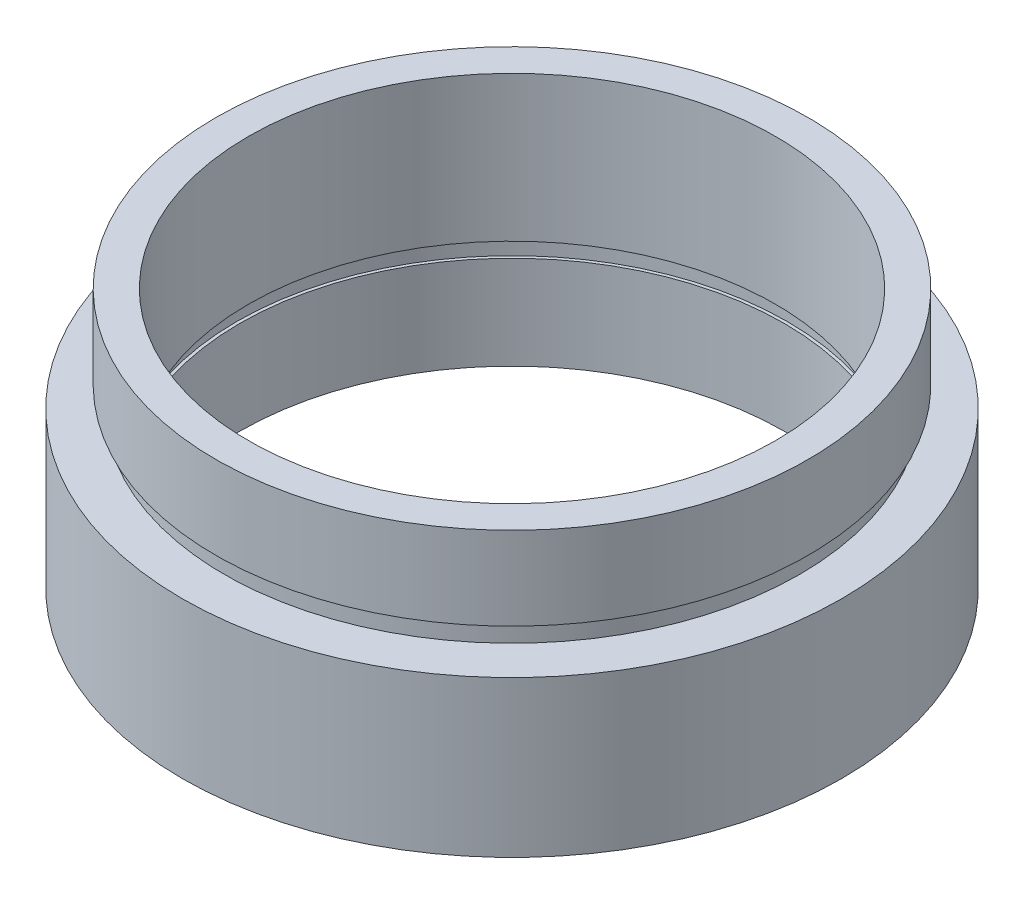
ISO-10303-21;
HEADER;
FILE_DESCRIPTION(('STEP AP214'),'2;1');
FILE_NAME('part.step','',(''),(''),'','','');
FILE_SCHEMA(('AUTOMOTIVE_DESIGN { 1 0 10303 214 1 1 1 1 }'));
ENDSEC;
DATA;
#1=APPLICATION_CONTEXT('core data for automotive mechanical design processes');
#2=APPLICATION_PROTOCOL_DEFINITION('international standard','automotive_design',2000,#1);
#3=PRODUCT_CONTEXT('',#1,'mechanical');
#4=PRODUCT('Part','Part','',(#3));
#5=PRODUCT_RELATED_PRODUCT_CATEGORY('part','',(#4));
#6=PRODUCT_DEFINITION_FORMATION('','',#4);
#7=PRODUCT_DEFINITION_CONTEXT('part definition',#1,'design');
#8=PRODUCT_DEFINITION('design','',#6,#7);
#9=PRODUCT_DEFINITION_SHAPE('','',#8);
#10=(LENGTH_UNIT() NAMED_UNIT(*) SI_UNIT(.MILLI.,.METRE.));
#11=(NAMED_UNIT(*) PLANE_ANGLE_UNIT() SI_UNIT($,.RADIAN.));
#12=(NAMED_UNIT(*) SI_UNIT($,.STERADIAN.) SOLID_ANGLE_UNIT());
#13=UNCERTAINTY_MEASURE_WITH_UNIT(LENGTH_MEASURE(1.E-05),#10,'distance_accuracy_value','');
#14=(GEOMETRIC_REPRESENTATION_CONTEXT(3) GLOBAL_UNCERTAINTY_ASSIGNED_CONTEXT((#13)) GLOBAL_UNIT_ASSIGNED_CONTEXT((#10,
#11,#12)) REPRESENTATION_CONTEXT('',''));
#15=CARTESIAN_POINT('',(0.,0.,0.));
#16=DIRECTION('',(0.,0.,1.));
#17=DIRECTION('',(1.,0.,0.));
#18=AXIS2_PLACEMENT_3D('',#15,#16,#17);
#19=CARTESIAN_POINT('',(15.875,0.,0.));
#20=DIRECTION('',(0.,1.,0.));
#21=DIRECTION('',(-1.,0.,0.));
#22=AXIS2_PLACEMENT_3D('',#19,#20,#21);
#23=PLANE('',#22);
#24=CARTESIAN_POINT('',(0.,0.,0.));
#25=DIRECTION('',(0.,1.,0.));
#26=DIRECTION('',(-1.,0.,0.));
#27=AXIS2_PLACEMENT_3D('',#24,#25,#26);
#28=CIRCLE('',#27,15.875);
#29=CARTESIAN_POINT('',(-15.875,0.,0.));
#30=VERTEX_POINT('',#29);
#31=EDGE_CURVE('E77',#30,#30,#28,.T.);
#32=ORIENTED_EDGE('',*,*,#31,.F.);
#33=EDGE_LOOP('',(#32));
#34=FACE_BOUND('',#33,.T.);
#35=CARTESIAN_POINT('',(0.,0.,0.));
#36=DIRECTION('',(0.,1.,0.));
#37=DIRECTION('',(-1.,0.,0.));
#38=AXIS2_PLACEMENT_3D('',#35,#36,#37);
#39=CIRCLE('',#38,13.1);
#40=CARTESIAN_POINT('',(-13.1,0.,0.));
#41=VERTEX_POINT('',#40);
#42=EDGE_CURVE('E10',#41,#41,#39,.T.);
#43=ORIENTED_EDGE('',*,*,#42,.T.);
#44=EDGE_LOOP('',(#43));
#45=FACE_BOUND('',#44,.T.);
#46=ADVANCED_FACE('F37',(#34,#45),#23,.F.);
#47=CARTESIAN_POINT('',(0.,16.8860182370821,0.));
#48=DIRECTION('',(0.,1.,0.));
#49=DIRECTION('',(-1.,0.,0.));
#50=AXIS2_PLACEMENT_3D('',#47,#48,#49);
#51=CYLINDRICAL_SURFACE('',#50,13.1);
#52=ORIENTED_EDGE('',*,*,#42,.F.);
#53=EDGE_LOOP('',(#52));
#54=FACE_BOUND('',#53,.T.);
#55=CARTESIAN_POINT('',(0.,4.5,0.));
#56=DIRECTION('',(0.,1.,0.));
#57=DIRECTION('',(-1.,0.,0.));
#58=AXIS2_PLACEMENT_3D('',#55,#56,#57);
#59=CIRCLE('',#58,13.1);
#60=CARTESIAN_POINT('',(-13.1,4.49999999999999,0.));
#61=VERTEX_POINT('',#60);
#62=EDGE_CURVE('E43',#61,#61,#59,.T.);
#63=ORIENTED_EDGE('',*,*,#62,.T.);
#64=EDGE_LOOP('',(#63));
#65=FACE_BOUND('',#64,.T.);
#66=ADVANCED_FACE('F84',(#54,#65),#51,.F.);
#67=CARTESIAN_POINT('',(13.1,4.5,0.));
#68=DIRECTION('',(0.,-1.,0.));
#69=DIRECTION('',(1.,0.,0.));
#70=AXIS2_PLACEMENT_3D('',#67,#68,#69);
#71=PLANE('',#70);
#72=ORIENTED_EDGE('',*,*,#62,.F.);
#73=EDGE_LOOP('',(#72));
#74=FACE_BOUND('',#73,.T.);
#75=CARTESIAN_POINT('',(0.,4.5,0.));
#76=DIRECTION('',(0.,1.,0.));
#77=DIRECTION('',(-1.,0.,0.));
#78=AXIS2_PLACEMENT_3D('',#75,#76,#77);
#79=CIRCLE('',#78,13.25);
#80=CARTESIAN_POINT('',(-13.25,4.49999999999999,0.));
#81=VERTEX_POINT('',#80);
#82=EDGE_CURVE('E47',#81,#81,#79,.T.);
#83=ORIENTED_EDGE('',*,*,#82,.T.);
#84=EDGE_LOOP('',(#83));
#85=FACE_BOUND('',#84,.T.);
#86=ADVANCED_FACE('F88',(#74,#85),#71,.F.);
#87=CARTESIAN_POINT('',(0.,16.8860182370821,0.));
#88=DIRECTION('',(0.,1.,0.));
#89=DIRECTION('',(-1.,0.,0.));
#90=AXIS2_PLACEMENT_3D('',#87,#88,#89);
#91=CYLINDRICAL_SURFACE('',#90,13.25);
#92=ORIENTED_EDGE('',*,*,#82,.F.);
#93=EDGE_LOOP('',(#92));
#94=FACE_BOUND('',#93,.T.);
#95=CARTESIAN_POINT('',(0.,5.5,0.));
#96=DIRECTION('',(0.,1.,0.));
#97=DIRECTION('',(-1.,0.,0.));
#98=AXIS2_PLACEMENT_3D('',#95,#96,#97);
#99=CIRCLE('',#98,13.25);
#100=CARTESIAN_POINT('',(-13.25,5.49999999999999,0.));
#101=VERTEX_POINT('',#100);
#102=EDGE_CURVE('E51',#101,#101,#99,.T.);
#103=ORIENTED_EDGE('',*,*,#102,.T.);
#104=EDGE_LOOP('',(#103));
#105=FACE_BOUND('',#104,.T.);
#106=ADVANCED_FACE('F93',(#94,#105),#91,.F.);
#107=CARTESIAN_POINT('',(12.69,5.5,0.));
#108=DIRECTION('',(0.,1.,0.));
#109=DIRECTION('',(-1.,0.,0.));
#110=AXIS2_PLACEMENT_3D('',#107,#108,#109);
#111=PLANE('',#110);
#112=ORIENTED_EDGE('',*,*,#102,.F.);
#113=EDGE_LOOP('',(#112));
#114=FACE_BOUND('',#113,.T.);
#115=CARTESIAN_POINT('',(0.,5.5,0.));
#116=DIRECTION('',(0.,1.,0.));
#117=DIRECTION('',(-1.,0.,0.));
#118=AXIS2_PLACEMENT_3D('',#115,#116,#117);
#119=CIRCLE('',#118,12.69);
#120=CARTESIAN_POINT('',(-12.69,5.49999999999999,0.));
#121=VERTEX_POINT('',#120);
#122=EDGE_CURVE('E56',#121,#121,#119,.T.);
#123=ORIENTED_EDGE('',*,*,#122,.T.);
#124=EDGE_LOOP('',(#123));
#125=FACE_BOUND('',#124,.T.);
#126=ADVANCED_FACE('F99',(#114,#125),#111,.F.);
#127=CARTESIAN_POINT('',(0.,16.8860182370821,0.));
#128=DIRECTION('',(0.,1.,0.));
#129=DIRECTION('',(-1.,0.,0.));
#130=AXIS2_PLACEMENT_3D('',#127,#128,#129);
#131=CYLINDRICAL_SURFACE('',#130,12.69);
#132=ORIENTED_EDGE('',*,*,#122,.F.);
#133=EDGE_LOOP('',(#132));
#134=FACE_BOUND('',#133,.T.);
#135=CARTESIAN_POINT('',(0.,12.5,0.));
#136=DIRECTION('',(0.,1.,0.));
#137=DIRECTION('',(-1.,0.,0.));
#138=AXIS2_PLACEMENT_3D('',#135,#136,#137);
#139=CIRCLE('',#138,12.69);
#140=CARTESIAN_POINT('',(-12.69,12.5,0.));
#141=VERTEX_POINT('',#140);
#142=EDGE_CURVE('E59',#141,#141,#139,.T.);
#143=ORIENTED_EDGE('',*,*,#142,.T.);
#144=EDGE_LOOP('',(#143));
#145=FACE_BOUND('',#144,.T.);
#146=ADVANCED_FACE('F103',(#134,#145),#131,.F.);
#147=CARTESIAN_POINT('',(12.69,12.5,0.));
#148=DIRECTION('',(0.,-1.,0.));
#149=DIRECTION('',(1.,0.,0.));
#150=AXIS2_PLACEMENT_3D('',#147,#148,#149);
#151=PLANE('',#150);
#152=ORIENTED_EDGE('',*,*,#142,.F.);
#153=EDGE_LOOP('',(#152));
#154=FACE_BOUND('',#153,.T.);
#155=CARTESIAN_POINT('',(0.,12.5,0.));
#156=DIRECTION('',(0.,1.,0.));
#157=DIRECTION('',(-1.,0.,0.));
#158=AXIS2_PLACEMENT_3D('',#155,#156,#157);
#159=CIRCLE('',#158,14.26);
#160=CARTESIAN_POINT('',(-14.26,12.5,0.));
#161=VERTEX_POINT('',#160);
#162=EDGE_CURVE('E62',#161,#161,#159,.T.);
#163=ORIENTED_EDGE('',*,*,#162,.T.);
#164=EDGE_LOOP('',(#163));
#165=FACE_BOUND('',#164,.T.);
#166=ADVANCED_FACE('F107',(#154,#165),#151,.F.);
#167=CARTESIAN_POINT('',(0.,16.8860182370821,0.));
#168=DIRECTION('',(0.,1.,0.));
#169=DIRECTION('',(-1.,0.,0.));
#170=AXIS2_PLACEMENT_3D('',#167,#168,#169);
#171=CYLINDRICAL_SURFACE('',#170,14.26);
#172=ORIENTED_EDGE('',*,*,#162,.F.);
#173=EDGE_LOOP('',(#172));
#174=FACE_BOUND('',#173,.T.);
#175=CARTESIAN_POINT('',(0.,8.5,0.));
#176=DIRECTION('',(0.,1.,0.));
#177=DIRECTION('',(-1.,0.,0.));
#178=AXIS2_PLACEMENT_3D('',#175,#176,#177);
#179=CIRCLE('',#178,14.26);
#180=CARTESIAN_POINT('',(-14.26,8.5,0.));
#181=VERTEX_POINT('',#180);
#182=EDGE_CURVE('E65',#181,#181,#179,.T.);
#183=ORIENTED_EDGE('',*,*,#182,.T.);
#184=EDGE_LOOP('',(#183));
#185=FACE_BOUND('',#184,.T.);
#186=ADVANCED_FACE('F111',(#174,#185),#171,.T.);
#187=CARTESIAN_POINT('',(14.26,8.5,0.));
#188=DIRECTION('',(0.,1.,0.));
#189=DIRECTION('',(-1.,0.,0.));
#190=AXIS2_PLACEMENT_3D('',#187,#188,#189);
#191=PLANE('',#190);
#192=ORIENTED_EDGE('',*,*,#182,.F.);
#193=EDGE_LOOP('',(#192));
#194=FACE_BOUND('',#193,.T.);
#195=CARTESIAN_POINT('',(0.,8.5,0.));
#196=DIRECTION('',(0.,1.,0.));
#197=DIRECTION('',(-1.,0.,0.));
#198=AXIS2_PLACEMENT_3D('',#195,#196,#197);
#199=CIRCLE('',#198,13.85);
#200=CARTESIAN_POINT('',(-13.85,8.5,0.));
#201=VERTEX_POINT('',#200);
#202=EDGE_CURVE('E68',#201,#201,#199,.T.);
#203=ORIENTED_EDGE('',*,*,#202,.T.);
#204=EDGE_LOOP('',(#203));
#205=FACE_BOUND('',#204,.T.);
#206=ADVANCED_FACE('F115',(#194,#205),#191,.F.);
#207=CARTESIAN_POINT('',(0.,16.8860182370821,0.));
#208=DIRECTION('',(0.,1.,0.));
#209=DIRECTION('',(-1.,0.,0.));
#210=AXIS2_PLACEMENT_3D('',#207,#208,#209);
#211=CYLINDRICAL_SURFACE('',#210,13.85);
#212=ORIENTED_EDGE('',*,*,#202,.F.);
#213=EDGE_LOOP('',(#212));
#214=FACE_BOUND('',#213,.T.);
#215=CARTESIAN_POINT('',(0.,7.5,0.));
#216=DIRECTION('',(0.,1.,0.));
#217=DIRECTION('',(-1.,0.,0.));
#218=AXIS2_PLACEMENT_3D('',#215,#216,#217);
#219=CIRCLE('',#218,13.85);
#220=CARTESIAN_POINT('',(-13.85,7.5,0.));
#221=VERTEX_POINT('',#220);
#222=EDGE_CURVE('E71',#221,#221,#219,.T.);
#223=ORIENTED_EDGE('',*,*,#222,.T.);
#224=EDGE_LOOP('',(#223));
#225=FACE_BOUND('',#224,.T.);
#226=ADVANCED_FACE('F119',(#214,#225),#211,.T.);
#227=CARTESIAN_POINT('',(13.85,7.5,0.));
#228=DIRECTION('',(0.,-1.,0.));
#229=DIRECTION('',(1.,0.,0.));
#230=AXIS2_PLACEMENT_3D('',#227,#228,#229);
#231=PLANE('',#230);
#232=ORIENTED_EDGE('',*,*,#222,.F.);
#233=EDGE_LOOP('',(#232));
#234=FACE_BOUND('',#233,.T.);
#235=CARTESIAN_POINT('',(0.,7.5,0.));
#236=DIRECTION('',(0.,1.,0.));
#237=DIRECTION('',(-1.,0.,0.));
#238=AXIS2_PLACEMENT_3D('',#235,#236,#237);
#239=CIRCLE('',#238,15.875);
#240=CARTESIAN_POINT('',(-15.875,7.5,0.));
#241=VERTEX_POINT('',#240);
#242=EDGE_CURVE('E74',#241,#241,#239,.T.);
#243=ORIENTED_EDGE('',*,*,#242,.T.);
#244=EDGE_LOOP('',(#243));
#245=FACE_BOUND('',#244,.T.);
#246=ADVANCED_FACE('F123',(#234,#245),#231,.F.);
#247=CARTESIAN_POINT('',(0.,16.8860182370821,0.));
#248=DIRECTION('',(0.,1.,0.));
#249=DIRECTION('',(-1.,0.,0.));
#250=AXIS2_PLACEMENT_3D('',#247,#248,#249);
#251=CYLINDRICAL_SURFACE('',#250,15.875);
#252=ORIENTED_EDGE('',*,*,#242,.F.);
#253=EDGE_LOOP('',(#252));
#254=FACE_BOUND('',#253,.T.);
#255=ORIENTED_EDGE('',*,*,#31,.T.);
#256=EDGE_LOOP('',(#255));
#257=FACE_BOUND('',#256,.T.);
#258=ADVANCED_FACE('F81',(#254,#257),#251,.T.);
#259=CLOSED_SHELL('',(#46,#66,#86,#106,#126,#146,#166,#186,#206,#226,#246,#258));
#260=MANIFOLD_SOLID_BREP('B2',#259);
#261=ADVANCED_BREP_SHAPE_REPRESENTATION('',(#18,#260),#14);
#262=SHAPE_DEFINITION_REPRESENTATION(#9,#261);
ENDSEC;
END-ISO-10303-21;
